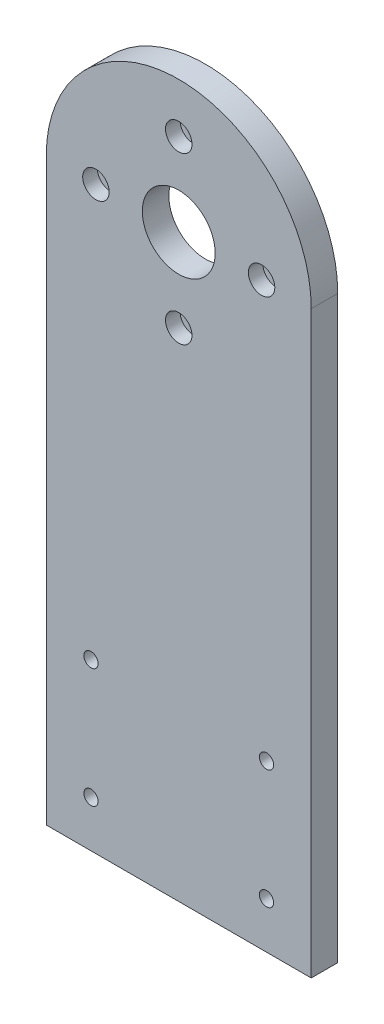
ISO-10303-21;
HEADER;
FILE_DESCRIPTION(('STEP AP214'),'2;1');
FILE_NAME('part.step','',(''),(''),'','','');
FILE_SCHEMA(('AUTOMOTIVE_DESIGN { 1 0 10303 214 1 1 1 1 }'));
ENDSEC;
DATA;
#1=APPLICATION_CONTEXT('core data for automotive mechanical design processes');
#2=APPLICATION_PROTOCOL_DEFINITION('international standard','automotive_design',2000,#1);
#3=PRODUCT_CONTEXT('',#1,'mechanical');
#4=PRODUCT('Part','Part','',(#3));
#5=PRODUCT_RELATED_PRODUCT_CATEGORY('part','',(#4));
#6=PRODUCT_DEFINITION_FORMATION('','',#4);
#7=PRODUCT_DEFINITION_CONTEXT('part definition',#1,'design');
#8=PRODUCT_DEFINITION('design','',#6,#7);
#9=PRODUCT_DEFINITION_SHAPE('','',#8);
#10=(LENGTH_UNIT() NAMED_UNIT(*) SI_UNIT(.MILLI.,.METRE.));
#11=(NAMED_UNIT(*) PLANE_ANGLE_UNIT() SI_UNIT($,.RADIAN.));
#12=(NAMED_UNIT(*) SI_UNIT($,.STERADIAN.) SOLID_ANGLE_UNIT());
#13=UNCERTAINTY_MEASURE_WITH_UNIT(LENGTH_MEASURE(1.E-05),#10,'distance_accuracy_value','');
#14=(GEOMETRIC_REPRESENTATION_CONTEXT(3) GLOBAL_UNCERTAINTY_ASSIGNED_CONTEXT((#13)) GLOBAL_UNIT_ASSIGNED_CONTEXT((#10,
#11,#12)) REPRESENTATION_CONTEXT('',''));
#15=CARTESIAN_POINT('',(0.,0.,0.));
#16=DIRECTION('',(0.,0.,1.));
#17=DIRECTION('',(1.,0.,0.));
#18=AXIS2_PLACEMENT_3D('',#15,#16,#17);
#19=CARTESIAN_POINT('',(-40.,175.,8.));
#20=DIRECTION('',(0.,0.,1.));
#21=DIRECTION('',(1.,0.,0.));
#22=AXIS2_PLACEMENT_3D('',#19,#20,#21);
#23=PLANE('',#22);
#24=CARTESIAN_POINT('',(-66.5,50.,8.));
#25=DIRECTION('',(0.,0.,1.));
#26=DIRECTION('',(1.,0.,0.));
#27=AXIS2_PLACEMENT_3D('',#24,#25,#26);
#28=CIRCLE('',#27,2.14999999999999);
#29=CARTESIAN_POINT('',(-64.35,50.,8.));
#30=VERTEX_POINT('',#29);
#31=EDGE_CURVE('E185',#30,#30,#28,.T.);
#32=ORIENTED_EDGE('',*,*,#31,.F.);
#33=EDGE_LOOP('',(#32));
#34=FACE_BOUND('',#33,.T.);
#35=CARTESIAN_POINT('',(-13.5,14.,8.));
#36=DIRECTION('',(0.,0.,1.));
#37=DIRECTION('',(1.,0.,0.));
#38=AXIS2_PLACEMENT_3D('',#35,#36,#37);
#39=CIRCLE('',#38,2.14999999999999);
#40=CARTESIAN_POINT('',(-11.35,14.,8.));
#41=VERTEX_POINT('',#40);
#42=EDGE_CURVE('E179',#41,#41,#39,.T.);
#43=ORIENTED_EDGE('',*,*,#42,.F.);
#44=EDGE_LOOP('',(#43));
#45=FACE_BOUND('',#44,.T.);
#46=CARTESIAN_POINT('',(-66.5,14.,8.));
#47=DIRECTION('',(0.,0.,1.));
#48=DIRECTION('',(1.,0.,0.));
#49=AXIS2_PLACEMENT_3D('',#46,#47,#48);
#50=CIRCLE('',#49,2.14999999999999);
#51=CARTESIAN_POINT('',(-64.35,14.,8.));
#52=VERTEX_POINT('',#51);
#53=EDGE_CURVE('E173',#52,#52,#50,.T.);
#54=ORIENTED_EDGE('',*,*,#53,.F.);
#55=EDGE_LOOP('',(#54));
#56=FACE_BOUND('',#55,.T.);
#57=CARTESIAN_POINT('',(-13.5,50.,8.));
#58=DIRECTION('',(0.,0.,1.));
#59=DIRECTION('',(1.,0.,0.));
#60=AXIS2_PLACEMENT_3D('',#57,#58,#59);
#61=CIRCLE('',#60,2.14999999999999);
#62=CARTESIAN_POINT('',(-11.35,50.,8.));
#63=VERTEX_POINT('',#62);
#64=EDGE_CURVE('E167',#63,#63,#61,.T.);
#65=ORIENTED_EDGE('',*,*,#64,.F.);
#66=EDGE_LOOP('',(#65));
#67=FACE_BOUND('',#66,.T.);
#68=CARTESIAN_POINT('',(-40.,175.,8.));
#69=DIRECTION('',(0.,0.,1.));
#70=DIRECTION('',(1.,0.,0.));
#71=AXIS2_PLACEMENT_3D('',#68,#69,#70);
#72=CIRCLE('',#71,11.);
#73=CARTESIAN_POINT('',(-29.,175.,8.));
#74=VERTEX_POINT('',#73);
#75=EDGE_CURVE('E161',#74,#74,#72,.T.);
#76=ORIENTED_EDGE('',*,*,#75,.F.);
#77=EDGE_LOOP('',(#76));
#78=FACE_BOUND('',#77,.T.);
#79=CARTESIAN_POINT('',(-40.,200.,8.));
#80=DIRECTION('',(0.,0.,1.));
#81=DIRECTION('',(1.,0.,0.));
#82=AXIS2_PLACEMENT_3D('',#79,#80,#81);
#83=CIRCLE('',#82,4.);
#84=CARTESIAN_POINT('',(-36.,200.,8.));
#85=VERTEX_POINT('',#84);
#86=EDGE_CURVE('E155',#85,#85,#83,.T.);
#87=ORIENTED_EDGE('',*,*,#86,.F.);
#88=EDGE_LOOP('',(#87));
#89=FACE_BOUND('',#88,.T.);
#90=CARTESIAN_POINT('',(-15.,175.,8.));
#91=DIRECTION('',(0.,0.,1.));
#92=DIRECTION('',(1.,0.,0.));
#93=AXIS2_PLACEMENT_3D('',#90,#91,#92);
#94=CIRCLE('',#93,3.99999999999999);
#95=CARTESIAN_POINT('',(-11.,175.,8.));
#96=VERTEX_POINT('',#95);
#97=EDGE_CURVE('E143',#96,#96,#94,.T.);
#98=ORIENTED_EDGE('',*,*,#97,.F.);
#99=EDGE_LOOP('',(#98));
#100=FACE_BOUND('',#99,.T.);
#101=CARTESIAN_POINT('',(-40.,150.,8.));
#102=DIRECTION('',(0.,0.,1.));
#103=DIRECTION('',(1.,0.,0.));
#104=AXIS2_PLACEMENT_3D('',#101,#102,#103);
#105=CIRCLE('',#104,3.99999999999999);
#106=CARTESIAN_POINT('',(-36.,150.,8.));
#107=VERTEX_POINT('',#106);
#108=EDGE_CURVE('E131',#107,#107,#105,.T.);
#109=ORIENTED_EDGE('',*,*,#108,.F.);
#110=EDGE_LOOP('',(#109));
#111=FACE_BOUND('',#110,.T.);
#112=CARTESIAN_POINT('',(-64.9999999999999,175.,8.));
#113=DIRECTION('',(0.,0.,1.));
#114=DIRECTION('',(1.,0.,0.));
#115=AXIS2_PLACEMENT_3D('',#112,#113,#114);
#116=CIRCLE('',#115,3.99999999999999);
#117=CARTESIAN_POINT('',(-61.,175.,8.));
#118=VERTEX_POINT('',#117);
#119=EDGE_CURVE('E119',#118,#118,#116,.T.);
#120=ORIENTED_EDGE('',*,*,#119,.F.);
#121=EDGE_LOOP('',(#120));
#122=FACE_BOUND('',#121,.T.);
#123=DIRECTION('',(0.,1.,0.));
#124=VECTOR('',#123,1.);
#125=CARTESIAN_POINT('',(0.,0.,8.));
#126=LINE('',#125,#124);
#127=CARTESIAN_POINT('',(0.,0.,8.));
#128=VERTEX_POINT('',#127);
#129=CARTESIAN_POINT('',(0.,175.,8.));
#130=VERTEX_POINT('',#129);
#131=EDGE_CURVE('E85',#128,#130,#126,.T.);
#132=ORIENTED_EDGE('',*,*,#131,.T.);
#133=CARTESIAN_POINT('',(-40.,175.,8.));
#134=DIRECTION('',(0.,0.,1.));
#135=DIRECTION('',(1.,0.,0.));
#136=AXIS2_PLACEMENT_3D('',#133,#134,#135);
#137=CIRCLE('',#136,40.);
#138=CARTESIAN_POINT('',(-80.,175.,8.));
#139=VERTEX_POINT('',#138);
#140=EDGE_CURVE('E81',#130,#139,#137,.T.);
#141=ORIENTED_EDGE('',*,*,#140,.T.);
#142=DIRECTION('',(0.,-1.,0.));
#143=VECTOR('',#142,1.);
#144=CARTESIAN_POINT('',(-80.,0.,8.));
#145=LINE('',#144,#143);
#146=CARTESIAN_POINT('',(-80.,0.,8.));
#147=VERTEX_POINT('',#146);
#148=EDGE_CURVE('E83',#139,#147,#145,.T.);
#149=ORIENTED_EDGE('',*,*,#148,.T.);
#150=DIRECTION('',(1.,0.,0.));
#151=VECTOR('',#150,1.);
#152=CARTESIAN_POINT('',(0.,0.,8.));
#153=LINE('',#152,#151);
#154=EDGE_CURVE('E51',#147,#128,#153,.T.);
#155=ORIENTED_EDGE('',*,*,#154,.T.);
#156=EDGE_LOOP('',(#132,#141,#149,#155));
#157=FACE_BOUND('',#156,.T.);
#158=ADVANCED_FACE('F34',(#34,#45,#56,#67,#78,#89,#100,#111,#122,#157),#23,.T.);
#159=CARTESIAN_POINT('',(-40.,175.,0.));
#160=DIRECTION('',(0.,0.,1.));
#161=DIRECTION('',(1.,0.,0.));
#162=AXIS2_PLACEMENT_3D('',#159,#160,#161);
#163=PLANE('',#162);
#164=CARTESIAN_POINT('',(-66.5,50.,0.));
#165=DIRECTION('',(0.,0.,1.));
#166=DIRECTION('',(1.,0.,0.));
#167=AXIS2_PLACEMENT_3D('',#164,#165,#166);
#168=CIRCLE('',#167,2.15);
#169=CARTESIAN_POINT('',(-64.35,50.,0.));
#170=VERTEX_POINT('',#169);
#171=EDGE_CURVE('E182',#170,#170,#168,.T.);
#172=ORIENTED_EDGE('',*,*,#171,.T.);
#173=EDGE_LOOP('',(#172));
#174=FACE_BOUND('',#173,.T.);
#175=CARTESIAN_POINT('',(-13.5,14.,0.));
#176=DIRECTION('',(0.,0.,1.));
#177=DIRECTION('',(1.,0.,0.));
#178=AXIS2_PLACEMENT_3D('',#175,#176,#177);
#179=CIRCLE('',#178,2.15);
#180=CARTESIAN_POINT('',(-11.35,14.,0.));
#181=VERTEX_POINT('',#180);
#182=EDGE_CURVE('E176',#181,#181,#179,.T.);
#183=ORIENTED_EDGE('',*,*,#182,.T.);
#184=EDGE_LOOP('',(#183));
#185=FACE_BOUND('',#184,.T.);
#186=CARTESIAN_POINT('',(-66.5,14.,0.));
#187=DIRECTION('',(0.,0.,1.));
#188=DIRECTION('',(1.,0.,0.));
#189=AXIS2_PLACEMENT_3D('',#186,#187,#188);
#190=CIRCLE('',#189,2.15);
#191=CARTESIAN_POINT('',(-64.35,14.,0.));
#192=VERTEX_POINT('',#191);
#193=EDGE_CURVE('E170',#192,#192,#190,.T.);
#194=ORIENTED_EDGE('',*,*,#193,.T.);
#195=EDGE_LOOP('',(#194));
#196=FACE_BOUND('',#195,.T.);
#197=CARTESIAN_POINT('',(-13.5,50.,0.));
#198=DIRECTION('',(0.,0.,1.));
#199=DIRECTION('',(1.,0.,0.));
#200=AXIS2_PLACEMENT_3D('',#197,#198,#199);
#201=CIRCLE('',#200,2.15);
#202=CARTESIAN_POINT('',(-11.35,50.,0.));
#203=VERTEX_POINT('',#202);
#204=EDGE_CURVE('E164',#203,#203,#201,.T.);
#205=ORIENTED_EDGE('',*,*,#204,.T.);
#206=EDGE_LOOP('',(#205));
#207=FACE_BOUND('',#206,.T.);
#208=CARTESIAN_POINT('',(-40.,175.,0.));
#209=DIRECTION('',(0.,0.,1.));
#210=DIRECTION('',(1.,0.,0.));
#211=AXIS2_PLACEMENT_3D('',#208,#209,#210);
#212=CIRCLE('',#211,11.);
#213=CARTESIAN_POINT('',(-29.,175.,0.));
#214=VERTEX_POINT('',#213);
#215=EDGE_CURVE('E158',#214,#214,#212,.T.);
#216=ORIENTED_EDGE('',*,*,#215,.T.);
#217=EDGE_LOOP('',(#216));
#218=FACE_BOUND('',#217,.T.);
#219=CARTESIAN_POINT('',(-40.,200.,0.));
#220=DIRECTION('',(0.,0.,1.));
#221=DIRECTION('',(1.,0.,0.));
#222=AXIS2_PLACEMENT_3D('',#219,#220,#221);
#223=CIRCLE('',#222,2.15);
#224=CARTESIAN_POINT('',(-37.85,200.,0.));
#225=VERTEX_POINT('',#224);
#226=EDGE_CURVE('E146',#225,#225,#223,.T.);
#227=ORIENTED_EDGE('',*,*,#226,.T.);
#228=EDGE_LOOP('',(#227));
#229=FACE_BOUND('',#228,.T.);
#230=CARTESIAN_POINT('',(-15.,175.,0.));
#231=DIRECTION('',(0.,0.,1.));
#232=DIRECTION('',(1.,0.,0.));
#233=AXIS2_PLACEMENT_3D('',#230,#231,#232);
#234=CIRCLE('',#233,2.15);
#235=CARTESIAN_POINT('',(-12.85,175.,0.));
#236=VERTEX_POINT('',#235);
#237=EDGE_CURVE('E134',#236,#236,#234,.T.);
#238=ORIENTED_EDGE('',*,*,#237,.T.);
#239=EDGE_LOOP('',(#238));
#240=FACE_BOUND('',#239,.T.);
#241=CARTESIAN_POINT('',(-40.,150.,0.));
#242=DIRECTION('',(0.,0.,1.));
#243=DIRECTION('',(1.,0.,0.));
#244=AXIS2_PLACEMENT_3D('',#241,#242,#243);
#245=CIRCLE('',#244,2.15);
#246=CARTESIAN_POINT('',(-37.85,150.,0.));
#247=VERTEX_POINT('',#246);
#248=EDGE_CURVE('E122',#247,#247,#245,.T.);
#249=ORIENTED_EDGE('',*,*,#248,.T.);
#250=EDGE_LOOP('',(#249));
#251=FACE_BOUND('',#250,.T.);
#252=CARTESIAN_POINT('',(-64.9999999999999,175.,0.));
#253=DIRECTION('',(0.,0.,1.));
#254=DIRECTION('',(1.,0.,0.));
#255=AXIS2_PLACEMENT_3D('',#252,#253,#254);
#256=CIRCLE('',#255,2.15);
#257=CARTESIAN_POINT('',(-62.8499999999999,175.,0.));
#258=VERTEX_POINT('',#257);
#259=EDGE_CURVE('E100',#258,#258,#256,.T.);
#260=ORIENTED_EDGE('',*,*,#259,.T.);
#261=EDGE_LOOP('',(#260));
#262=FACE_BOUND('',#261,.T.);
#263=DIRECTION('',(0.,1.,0.));
#264=VECTOR('',#263,1.);
#265=CARTESIAN_POINT('',(0.,0.,0.));
#266=LINE('',#265,#264);
#267=CARTESIAN_POINT('',(0.,0.,0.));
#268=VERTEX_POINT('',#267);
#269=CARTESIAN_POINT('',(0.,175.,0.));
#270=VERTEX_POINT('',#269);
#271=EDGE_CURVE('E97',#268,#270,#266,.T.);
#272=ORIENTED_EDGE('',*,*,#271,.F.);
#273=DIRECTION('',(1.,0.,0.));
#274=VECTOR('',#273,1.);
#275=CARTESIAN_POINT('',(0.,0.,0.));
#276=LINE('',#275,#274);
#277=CARTESIAN_POINT('',(-80.,0.,0.));
#278=VERTEX_POINT('',#277);
#279=EDGE_CURVE('E74',#278,#268,#276,.T.);
#280=ORIENTED_EDGE('',*,*,#279,.F.);
#281=DIRECTION('',(0.,-1.,0.));
#282=VECTOR('',#281,1.);
#283=CARTESIAN_POINT('',(-80.,0.,0.));
#284=LINE('',#283,#282);
#285=CARTESIAN_POINT('',(-80.,175.,0.));
#286=VERTEX_POINT('',#285);
#287=EDGE_CURVE('E68',#286,#278,#284,.T.);
#288=ORIENTED_EDGE('',*,*,#287,.F.);
#289=CARTESIAN_POINT('',(-40.,175.,0.));
#290=DIRECTION('',(0.,0.,1.));
#291=DIRECTION('',(1.,0.,0.));
#292=AXIS2_PLACEMENT_3D('',#289,#290,#291);
#293=CIRCLE('',#292,40.);
#294=EDGE_CURVE('E89',#270,#286,#293,.T.);
#295=ORIENTED_EDGE('',*,*,#294,.F.);
#296=EDGE_LOOP('',(#272,#280,#288,#295));
#297=FACE_BOUND('',#296,.T.);
#298=ADVANCED_FACE('F108',(#174,#185,#196,#207,#218,#229,#240,#251,#262,#297),#163,.F.);
#299=CARTESIAN_POINT('',(0.,0.,8.));
#300=DIRECTION('',(-1.,0.,0.));
#301=DIRECTION('',(0.,0.,1.));
#302=AXIS2_PLACEMENT_3D('',#299,#300,#301);
#303=PLANE('',#302);
#304=ORIENTED_EDGE('',*,*,#271,.T.);
#305=DIRECTION('',(0.,0.,-1.));
#306=VECTOR('',#305,1.);
#307=CARTESIAN_POINT('',(0.,175.,8.));
#308=LINE('',#307,#306);
#309=EDGE_CURVE('E11',#130,#270,#308,.T.);
#310=ORIENTED_EDGE('',*,*,#309,.F.);
#311=ORIENTED_EDGE('',*,*,#131,.F.);
#312=DIRECTION('',(0.,0.,-1.));
#313=VECTOR('',#312,1.);
#314=CARTESIAN_POINT('',(0.,0.,8.));
#315=LINE('',#314,#313);
#316=EDGE_CURVE('E93',#128,#268,#315,.T.);
#317=ORIENTED_EDGE('',*,*,#316,.T.);
#318=EDGE_LOOP('',(#304,#310,#311,#317));
#319=FACE_BOUND('',#318,.T.);
#320=ADVANCED_FACE('F36',(#319),#303,.F.);
#321=CARTESIAN_POINT('',(-40.,175.,8.));
#322=DIRECTION('',(0.,0.,-1.));
#323=DIRECTION('',(-1.,0.,0.));
#324=AXIS2_PLACEMENT_3D('',#321,#322,#323);
#325=CYLINDRICAL_SURFACE('',#324,40.);
#326=ORIENTED_EDGE('',*,*,#294,.T.);
#327=DIRECTION('',(0.,0.,-1.));
#328=VECTOR('',#327,1.);
#329=CARTESIAN_POINT('',(-80.,175.,8.));
#330=LINE('',#329,#328);
#331=EDGE_CURVE('E43',#139,#286,#330,.T.);
#332=ORIENTED_EDGE('',*,*,#331,.F.);
#333=ORIENTED_EDGE('',*,*,#140,.F.);
#334=ORIENTED_EDGE('',*,*,#309,.T.);
#335=EDGE_LOOP('',(#326,#332,#333,#334));
#336=FACE_BOUND('',#335,.T.);
#337=ADVANCED_FACE('F88',(#336),#325,.T.);
#338=CARTESIAN_POINT('',(-80.,0.,8.));
#339=DIRECTION('',(1.,0.,0.));
#340=DIRECTION('',(0.,0.,-1.));
#341=AXIS2_PLACEMENT_3D('',#338,#339,#340);
#342=PLANE('',#341);
#343=ORIENTED_EDGE('',*,*,#287,.T.);
#344=DIRECTION('',(0.,0.,-1.));
#345=VECTOR('',#344,1.);
#346=CARTESIAN_POINT('',(-80.,0.,8.));
#347=LINE('',#346,#345);
#348=EDGE_CURVE('E90',#147,#278,#347,.T.);
#349=ORIENTED_EDGE('',*,*,#348,.F.);
#350=ORIENTED_EDGE('',*,*,#148,.F.);
#351=ORIENTED_EDGE('',*,*,#331,.T.);
#352=EDGE_LOOP('',(#343,#349,#350,#351));
#353=FACE_BOUND('',#352,.T.);
#354=ADVANCED_FACE('F91',(#353),#342,.F.);
#355=CARTESIAN_POINT('',(0.,0.,8.));
#356=DIRECTION('',(0.,1.,0.));
#357=DIRECTION('',(0.,0.,1.));
#358=AXIS2_PLACEMENT_3D('',#355,#356,#357);
#359=PLANE('',#358);
#360=ORIENTED_EDGE('',*,*,#279,.T.);
#361=ORIENTED_EDGE('',*,*,#316,.F.);
#362=ORIENTED_EDGE('',*,*,#154,.F.);
#363=ORIENTED_EDGE('',*,*,#348,.T.);
#364=EDGE_LOOP('',(#360,#361,#362,#363));
#365=FACE_BOUND('',#364,.T.);
#366=ADVANCED_FACE('F105',(#365),#359,.F.);
#367=CARTESIAN_POINT('',(-64.9999999999999,175.,8.));
#368=DIRECTION('',(0.,0.,1.));
#369=DIRECTION('',(1.,0.,0.));
#370=AXIS2_PLACEMENT_3D('',#367,#368,#369);
#371=CYLINDRICAL_SURFACE('',#370,2.15000000000001);
#372=ORIENTED_EDGE('',*,*,#259,.F.);
#373=EDGE_LOOP('',(#372));
#374=FACE_BOUND('',#373,.T.);
#375=CARTESIAN_POINT('',(-64.9999999999999,175.,3.6));
#376=DIRECTION('',(0.,0.,1.));
#377=DIRECTION('',(1.,0.,0.));
#378=AXIS2_PLACEMENT_3D('',#375,#376,#377);
#379=CIRCLE('',#378,2.15000000000001);
#380=CARTESIAN_POINT('',(-62.8499999999999,175.,3.6));
#381=VERTEX_POINT('',#380);
#382=EDGE_CURVE('E113',#381,#381,#379,.T.);
#383=ORIENTED_EDGE('',*,*,#382,.T.);
#384=EDGE_LOOP('',(#383));
#385=FACE_BOUND('',#384,.T.);
#386=ADVANCED_FACE('F223',(#374,#385),#371,.F.);
#387=CARTESIAN_POINT('',(-62.8499999999999,175.,3.6));
#388=DIRECTION('',(0.,0.,-1.));
#389=DIRECTION('',(-1.,0.,0.));
#390=AXIS2_PLACEMENT_3D('',#387,#388,#389);
#391=PLANE('',#390);
#392=ORIENTED_EDGE('',*,*,#382,.F.);
#393=EDGE_LOOP('',(#392));
#394=FACE_BOUND('',#393,.T.);
#395=CARTESIAN_POINT('',(-64.9999999999999,175.,3.6));
#396=DIRECTION('',(0.,0.,1.));
#397=DIRECTION('',(1.,0.,0.));
#398=AXIS2_PLACEMENT_3D('',#395,#396,#397);
#399=CIRCLE('',#398,3.99999999999999);
#400=CARTESIAN_POINT('',(-61.,175.,3.6));
#401=VERTEX_POINT('',#400);
#402=EDGE_CURVE('E116',#401,#401,#399,.T.);
#403=ORIENTED_EDGE('',*,*,#402,.T.);
#404=EDGE_LOOP('',(#403));
#405=FACE_BOUND('',#404,.T.);
#406=ADVANCED_FACE('F213',(#394,#405),#391,.F.);
#407=CARTESIAN_POINT('',(-64.9999999999999,175.,8.));
#408=DIRECTION('',(0.,0.,1.));
#409=DIRECTION('',(1.,0.,0.));
#410=AXIS2_PLACEMENT_3D('',#407,#408,#409);
#411=CYLINDRICAL_SURFACE('',#410,3.99999999999999);
#412=ORIENTED_EDGE('',*,*,#402,.F.);
#413=EDGE_LOOP('',(#412));
#414=FACE_BOUND('',#413,.T.);
#415=ORIENTED_EDGE('',*,*,#119,.T.);
#416=EDGE_LOOP('',(#415));
#417=FACE_BOUND('',#416,.T.);
#418=ADVANCED_FACE('F210',(#414,#417),#411,.F.);
#419=CARTESIAN_POINT('',(-40.,150.,8.));
#420=DIRECTION('',(0.,0.,1.));
#421=DIRECTION('',(1.,0.,0.));
#422=AXIS2_PLACEMENT_3D('',#419,#420,#421);
#423=CYLINDRICAL_SURFACE('',#422,2.15000000000001);
#424=ORIENTED_EDGE('',*,*,#248,.F.);
#425=EDGE_LOOP('',(#424));
#426=FACE_BOUND('',#425,.T.);
#427=CARTESIAN_POINT('',(-40.,150.,3.6));
#428=DIRECTION('',(0.,0.,1.));
#429=DIRECTION('',(1.,0.,0.));
#430=AXIS2_PLACEMENT_3D('',#427,#428,#429);
#431=CIRCLE('',#430,2.15000000000001);
#432=CARTESIAN_POINT('',(-37.8499999999999,150.,3.6));
#433=VERTEX_POINT('',#432);
#434=EDGE_CURVE('E125',#433,#433,#431,.T.);
#435=ORIENTED_EDGE('',*,*,#434,.T.);
#436=EDGE_LOOP('',(#435));
#437=FACE_BOUND('',#436,.T.);
#438=ADVANCED_FACE('F212',(#426,#437),#423,.F.);
#439=CARTESIAN_POINT('',(-37.8499999999999,150.,3.6));
#440=DIRECTION('',(0.,0.,-1.));
#441=DIRECTION('',(-1.,0.,0.));
#442=AXIS2_PLACEMENT_3D('',#439,#440,#441);
#443=PLANE('',#442);
#444=ORIENTED_EDGE('',*,*,#434,.F.);
#445=EDGE_LOOP('',(#444));
#446=FACE_BOUND('',#445,.T.);
#447=CARTESIAN_POINT('',(-40.,150.,3.6));
#448=DIRECTION('',(0.,0.,1.));
#449=DIRECTION('',(1.,0.,0.));
#450=AXIS2_PLACEMENT_3D('',#447,#448,#449);
#451=CIRCLE('',#450,3.99999999999999);
#452=CARTESIAN_POINT('',(-36.,150.,3.6));
#453=VERTEX_POINT('',#452);
#454=EDGE_CURVE('E128',#453,#453,#451,.T.);
#455=ORIENTED_EDGE('',*,*,#454,.T.);
#456=EDGE_LOOP('',(#455));
#457=FACE_BOUND('',#456,.T.);
#458=ADVANCED_FACE('F220',(#446,#457),#443,.F.);
#459=CARTESIAN_POINT('',(-40.,150.,8.));
#460=DIRECTION('',(0.,0.,1.));
#461=DIRECTION('',(1.,0.,0.));
#462=AXIS2_PLACEMENT_3D('',#459,#460,#461);
#463=CYLINDRICAL_SURFACE('',#462,3.99999999999999);
#464=ORIENTED_EDGE('',*,*,#454,.F.);
#465=EDGE_LOOP('',(#464));
#466=FACE_BOUND('',#465,.T.);
#467=ORIENTED_EDGE('',*,*,#108,.T.);
#468=EDGE_LOOP('',(#467));
#469=FACE_BOUND('',#468,.T.);
#470=ADVANCED_FACE('F326',(#466,#469),#463,.F.);
#471=CARTESIAN_POINT('',(-15.,175.,8.));
#472=DIRECTION('',(0.,0.,1.));
#473=DIRECTION('',(1.,0.,0.));
#474=AXIS2_PLACEMENT_3D('',#471,#472,#473);
#475=CYLINDRICAL_SURFACE('',#474,2.15);
#476=ORIENTED_EDGE('',*,*,#237,.F.);
#477=EDGE_LOOP('',(#476));
#478=FACE_BOUND('',#477,.T.);
#479=CARTESIAN_POINT('',(-15.,175.,3.6));
#480=DIRECTION('',(0.,0.,1.));
#481=DIRECTION('',(1.,0.,0.));
#482=AXIS2_PLACEMENT_3D('',#479,#480,#481);
#483=CIRCLE('',#482,2.15000000000001);
#484=CARTESIAN_POINT('',(-12.8499999999999,175.,3.6));
#485=VERTEX_POINT('',#484);
#486=EDGE_CURVE('E137',#485,#485,#483,.T.);
#487=ORIENTED_EDGE('',*,*,#486,.T.);
#488=EDGE_LOOP('',(#487));
#489=FACE_BOUND('',#488,.T.);
#490=ADVANCED_FACE('F316',(#478,#489),#475,.F.);
#491=CARTESIAN_POINT('',(-12.8499999999999,175.,3.6));
#492=DIRECTION('',(0.,0.,-1.));
#493=DIRECTION('',(-1.,0.,0.));
#494=AXIS2_PLACEMENT_3D('',#491,#492,#493);
#495=PLANE('',#494);
#496=ORIENTED_EDGE('',*,*,#486,.F.);
#497=EDGE_LOOP('',(#496));
#498=FACE_BOUND('',#497,.T.);
#499=CARTESIAN_POINT('',(-15.,175.,3.6));
#500=DIRECTION('',(0.,0.,1.));
#501=DIRECTION('',(1.,0.,0.));
#502=AXIS2_PLACEMENT_3D('',#499,#500,#501);
#503=CIRCLE('',#502,3.99999999999999);
#504=CARTESIAN_POINT('',(-11.,175.,3.6));
#505=VERTEX_POINT('',#504);
#506=EDGE_CURVE('E140',#505,#505,#503,.T.);
#507=ORIENTED_EDGE('',*,*,#506,.T.);
#508=EDGE_LOOP('',(#507));
#509=FACE_BOUND('',#508,.T.);
#510=ADVANCED_FACE('F306',(#498,#509),#495,.F.);
#511=CARTESIAN_POINT('',(-15.,175.,8.));
#512=DIRECTION('',(0.,0.,1.));
#513=DIRECTION('',(1.,0.,0.));
#514=AXIS2_PLACEMENT_3D('',#511,#512,#513);
#515=CYLINDRICAL_SURFACE('',#514,3.99999999999999);
#516=ORIENTED_EDGE('',*,*,#506,.F.);
#517=EDGE_LOOP('',(#516));
#518=FACE_BOUND('',#517,.T.);
#519=ORIENTED_EDGE('',*,*,#97,.T.);
#520=EDGE_LOOP('',(#519));
#521=FACE_BOUND('',#520,.T.);
#522=ADVANCED_FACE('F296',(#518,#521),#515,.F.);
#523=CARTESIAN_POINT('',(-40.,200.,8.));
#524=DIRECTION('',(0.,0.,1.));
#525=DIRECTION('',(1.,0.,0.));
#526=AXIS2_PLACEMENT_3D('',#523,#524,#525);
#527=CYLINDRICAL_SURFACE('',#526,2.15000000000001);
#528=ORIENTED_EDGE('',*,*,#226,.F.);
#529=EDGE_LOOP('',(#528));
#530=FACE_BOUND('',#529,.T.);
#531=CARTESIAN_POINT('',(-40.,200.,3.6));
#532=DIRECTION('',(0.,0.,1.));
#533=DIRECTION('',(1.,0.,0.));
#534=AXIS2_PLACEMENT_3D('',#531,#532,#533);
#535=CIRCLE('',#534,2.15000000000001);
#536=CARTESIAN_POINT('',(-37.8499999999999,200.,3.6));
#537=VERTEX_POINT('',#536);
#538=EDGE_CURVE('E149',#537,#537,#535,.T.);
#539=ORIENTED_EDGE('',*,*,#538,.T.);
#540=EDGE_LOOP('',(#539));
#541=FACE_BOUND('',#540,.T.);
#542=ADVANCED_FACE('F286',(#530,#541),#527,.F.);
#543=CARTESIAN_POINT('',(-37.8499999999999,200.,3.6));
#544=DIRECTION('',(0.,0.,-1.));
#545=DIRECTION('',(-1.,0.,0.));
#546=AXIS2_PLACEMENT_3D('',#543,#544,#545);
#547=PLANE('',#546);
#548=ORIENTED_EDGE('',*,*,#538,.F.);
#549=EDGE_LOOP('',(#548));
#550=FACE_BOUND('',#549,.T.);
#551=CARTESIAN_POINT('',(-40.,200.,3.6));
#552=DIRECTION('',(0.,0.,1.));
#553=DIRECTION('',(1.,0.,0.));
#554=AXIS2_PLACEMENT_3D('',#551,#552,#553);
#555=CIRCLE('',#554,4.);
#556=CARTESIAN_POINT('',(-36.,200.,3.6));
#557=VERTEX_POINT('',#556);
#558=EDGE_CURVE('E152',#557,#557,#555,.T.);
#559=ORIENTED_EDGE('',*,*,#558,.T.);
#560=EDGE_LOOP('',(#559));
#561=FACE_BOUND('',#560,.T.);
#562=ADVANCED_FACE('F276',(#550,#561),#547,.F.);
#563=CARTESIAN_POINT('',(-40.,200.,8.));
#564=DIRECTION('',(0.,0.,1.));
#565=DIRECTION('',(1.,0.,0.));
#566=AXIS2_PLACEMENT_3D('',#563,#564,#565);
#567=CYLINDRICAL_SURFACE('',#566,4.);
#568=ORIENTED_EDGE('',*,*,#558,.F.);
#569=EDGE_LOOP('',(#568));
#570=FACE_BOUND('',#569,.T.);
#571=ORIENTED_EDGE('',*,*,#86,.T.);
#572=EDGE_LOOP('',(#571));
#573=FACE_BOUND('',#572,.T.);
#574=ADVANCED_FACE('F264',(#570,#573),#567,.F.);
#575=CARTESIAN_POINT('',(-40.,175.,8.));
#576=DIRECTION('',(0.,0.,1.));
#577=DIRECTION('',(1.,0.,0.));
#578=AXIS2_PLACEMENT_3D('',#575,#576,#577);
#579=CYLINDRICAL_SURFACE('',#578,11.);
#580=ORIENTED_EDGE('',*,*,#215,.F.);
#581=EDGE_LOOP('',(#580));
#582=FACE_BOUND('',#581,.T.);
#583=ORIENTED_EDGE('',*,*,#75,.T.);
#584=EDGE_LOOP('',(#583));
#585=FACE_BOUND('',#584,.T.);
#586=ADVANCED_FACE('F258',(#582,#585),#579,.F.);
#587=CARTESIAN_POINT('',(-13.5,50.,8.));
#588=DIRECTION('',(0.,0.,1.));
#589=DIRECTION('',(1.,0.,0.));
#590=AXIS2_PLACEMENT_3D('',#587,#588,#589);
#591=CYLINDRICAL_SURFACE('',#590,2.14999999999999);
#592=ORIENTED_EDGE('',*,*,#204,.F.);
#593=EDGE_LOOP('',(#592));
#594=FACE_BOUND('',#593,.T.);
#595=ORIENTED_EDGE('',*,*,#64,.T.);
#596=EDGE_LOOP('',(#595));
#597=FACE_BOUND('',#596,.T.);
#598=ADVANCED_FACE('F263',(#594,#597),#591,.F.);
#599=CARTESIAN_POINT('',(-66.5,14.,8.));
#600=DIRECTION('',(0.,0.,1.));
#601=DIRECTION('',(1.,0.,0.));
#602=AXIS2_PLACEMENT_3D('',#599,#600,#601);
#603=CYLINDRICAL_SURFACE('',#602,2.14999999999999);
#604=ORIENTED_EDGE('',*,*,#193,.F.);
#605=EDGE_LOOP('',(#604));
#606=FACE_BOUND('',#605,.T.);
#607=ORIENTED_EDGE('',*,*,#53,.T.);
#608=EDGE_LOOP('',(#607));
#609=FACE_BOUND('',#608,.T.);
#610=ADVANCED_FACE('F394',(#606,#609),#603,.F.);
#611=CARTESIAN_POINT('',(-13.5,14.,8.));
#612=DIRECTION('',(0.,0.,1.));
#613=DIRECTION('',(1.,0.,0.));
#614=AXIS2_PLACEMENT_3D('',#611,#612,#613);
#615=CYLINDRICAL_SURFACE('',#614,2.14999999999999);
#616=ORIENTED_EDGE('',*,*,#182,.F.);
#617=EDGE_LOOP('',(#616));
#618=FACE_BOUND('',#617,.T.);
#619=ORIENTED_EDGE('',*,*,#42,.T.);
#620=EDGE_LOOP('',(#619));
#621=FACE_BOUND('',#620,.T.);
#622=ADVANCED_FACE('F398',(#618,#621),#615,.F.);
#623=CARTESIAN_POINT('',(-66.5,50.,8.));
#624=DIRECTION('',(0.,0.,1.));
#625=DIRECTION('',(1.,0.,0.));
#626=AXIS2_PLACEMENT_3D('',#623,#624,#625);
#627=CYLINDRICAL_SURFACE('',#626,2.14999999999999);
#628=ORIENTED_EDGE('',*,*,#171,.F.);
#629=EDGE_LOOP('',(#628));
#630=FACE_BOUND('',#629,.T.);
#631=ORIENTED_EDGE('',*,*,#31,.T.);
#632=EDGE_LOOP('',(#631));
#633=FACE_BOUND('',#632,.T.);
#634=ADVANCED_FACE('F189',(#630,#633),#627,.F.);
#635=CLOSED_SHELL('',(#158,#298,#320,#337,#354,#366,#386,#406,#418,#438,#458,#470,#490,#510,
#522,#542,#562,#574,#586,#598,#610,#622,#634));
#636=MANIFOLD_SOLID_BREP('B2',#635);
#637=ADVANCED_BREP_SHAPE_REPRESENTATION('',(#18,#636),#14);
#638=SHAPE_DEFINITION_REPRESENTATION(#9,#637);
ENDSEC;
END-ISO-10303-21;
